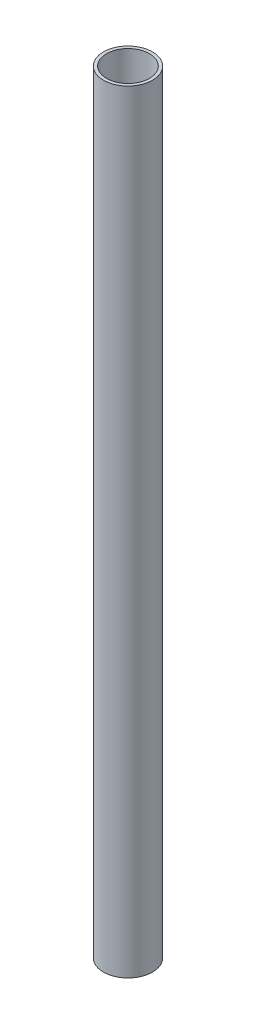
ISO-10303-21;
HEADER;
FILE_DESCRIPTION(('STEP AP214'),'2;1');
FILE_NAME('part.step','',(''),(''),'','','');
FILE_SCHEMA(('AUTOMOTIVE_DESIGN { 1 0 10303 214 1 1 1 1 }'));
ENDSEC;
DATA;
#1=APPLICATION_CONTEXT('core data for automotive mechanical design processes');
#2=APPLICATION_PROTOCOL_DEFINITION('international standard','automotive_design',2000,#1);
#3=PRODUCT_CONTEXT('',#1,'mechanical');
#4=PRODUCT('Part','Part','',(#3));
#5=PRODUCT_RELATED_PRODUCT_CATEGORY('part','',(#4));
#6=PRODUCT_DEFINITION_FORMATION('','',#4);
#7=PRODUCT_DEFINITION_CONTEXT('part definition',#1,'design');
#8=PRODUCT_DEFINITION('design','',#6,#7);
#9=PRODUCT_DEFINITION_SHAPE('','',#8);
#10=(LENGTH_UNIT() NAMED_UNIT(*) SI_UNIT(.MILLI.,.METRE.));
#11=(NAMED_UNIT(*) PLANE_ANGLE_UNIT() SI_UNIT($,.RADIAN.));
#12=(NAMED_UNIT(*) SI_UNIT($,.STERADIAN.) SOLID_ANGLE_UNIT());
#13=UNCERTAINTY_MEASURE_WITH_UNIT(LENGTH_MEASURE(1.E-05),#10,'distance_accuracy_value','');
#14=(GEOMETRIC_REPRESENTATION_CONTEXT(3) GLOBAL_UNCERTAINTY_ASSIGNED_CONTEXT((#13)) GLOBAL_UNIT_ASSIGNED_CONTEXT((#10,
#11,#12)) REPRESENTATION_CONTEXT('',''));
#15=CARTESIAN_POINT('',(0.,0.,0.));
#16=DIRECTION('',(0.,0.,1.));
#17=DIRECTION('',(1.,0.,0.));
#18=AXIS2_PLACEMENT_3D('',#15,#16,#17);
#19=CARTESIAN_POINT('',(0.,400.,0.));
#20=DIRECTION('',(0.,1.,0.));
#21=DIRECTION('',(0.,0.,1.));
#22=AXIS2_PLACEMENT_3D('',#19,#20,#21);
#23=PLANE('',#22);
#24=CARTESIAN_POINT('',(0.,400.,0.));
#25=DIRECTION('',(0.,1.,0.));
#26=DIRECTION('',(0.,0.,1.));
#27=AXIS2_PLACEMENT_3D('',#24,#25,#26);
#28=CIRCLE('',#27,12.7);
#29=CARTESIAN_POINT('',(0.,400.,12.7));
#30=VERTEX_POINT('',#29);
#31=EDGE_CURVE('E10',#30,#30,#28,.T.);
#32=ORIENTED_EDGE('',*,*,#31,.T.);
#33=EDGE_LOOP('',(#32));
#34=FACE_BOUND('',#33,.T.);
#35=CARTESIAN_POINT('',(0.,400.,0.));
#36=DIRECTION('',(0.,1.,0.));
#37=DIRECTION('',(0.,0.,1.));
#38=AXIS2_PLACEMENT_3D('',#35,#36,#37);
#39=CIRCLE('',#38,11.1125);
#40=CARTESIAN_POINT('',(0.,400.,11.1125));
#41=VERTEX_POINT('',#40);
#42=EDGE_CURVE('E48',#41,#41,#39,.T.);
#43=ORIENTED_EDGE('',*,*,#42,.F.);
#44=EDGE_LOOP('',(#43));
#45=FACE_BOUND('',#44,.T.);
#46=ADVANCED_FACE('F37',(#34,#45),#23,.T.);
#47=CARTESIAN_POINT('',(0.,0.,0.));
#48=DIRECTION('',(0.,1.,0.));
#49=DIRECTION('',(0.,0.,1.));
#50=AXIS2_PLACEMENT_3D('',#47,#48,#49);
#51=PLANE('',#50);
#52=CARTESIAN_POINT('',(0.,0.,0.));
#53=DIRECTION('',(0.,1.,0.));
#54=DIRECTION('',(0.,0.,1.));
#55=AXIS2_PLACEMENT_3D('',#52,#53,#54);
#56=CIRCLE('',#55,12.7);
#57=CARTESIAN_POINT('',(0.,0.,12.7));
#58=VERTEX_POINT('',#57);
#59=EDGE_CURVE('E41',#58,#58,#56,.T.);
#60=ORIENTED_EDGE('',*,*,#59,.F.);
#61=EDGE_LOOP('',(#60));
#62=FACE_BOUND('',#61,.T.);
#63=CARTESIAN_POINT('',(0.,0.,0.));
#64=DIRECTION('',(0.,1.,0.));
#65=DIRECTION('',(0.,0.,1.));
#66=AXIS2_PLACEMENT_3D('',#63,#64,#65);
#67=CIRCLE('',#66,11.1125);
#68=CARTESIAN_POINT('',(0.,0.,11.1125));
#69=VERTEX_POINT('',#68);
#70=EDGE_CURVE('E50',#69,#69,#67,.T.);
#71=ORIENTED_EDGE('',*,*,#70,.T.);
#72=EDGE_LOOP('',(#71));
#73=FACE_BOUND('',#72,.T.);
#74=ADVANCED_FACE('F60',(#62,#73),#51,.F.);
#75=CARTESIAN_POINT('',(0.,400.,0.));
#76=DIRECTION('',(0.,-1.,0.));
#77=DIRECTION('',(0.,0.,-1.));
#78=AXIS2_PLACEMENT_3D('',#75,#76,#77);
#79=CYLINDRICAL_SURFACE('',#78,12.7);
#80=ORIENTED_EDGE('',*,*,#31,.F.);
#81=EDGE_LOOP('',(#80));
#82=FACE_BOUND('',#81,.T.);
#83=ORIENTED_EDGE('',*,*,#59,.T.);
#84=EDGE_LOOP('',(#83));
#85=FACE_BOUND('',#84,.T.);
#86=ADVANCED_FACE('F39',(#82,#85),#79,.T.);
#87=CARTESIAN_POINT('',(0.,400.,0.));
#88=DIRECTION('',(0.,-1.,0.));
#89=DIRECTION('',(0.,0.,-1.));
#90=AXIS2_PLACEMENT_3D('',#87,#88,#89);
#91=CYLINDRICAL_SURFACE('',#90,11.1125);
#92=ORIENTED_EDGE('',*,*,#42,.T.);
#93=EDGE_LOOP('',(#92));
#94=FACE_BOUND('',#93,.T.);
#95=ORIENTED_EDGE('',*,*,#70,.F.);
#96=EDGE_LOOP('',(#95));
#97=FACE_BOUND('',#96,.T.);
#98=ADVANCED_FACE('F56',(#94,#97),#91,.F.);
#99=CLOSED_SHELL('',(#46,#74,#86,#98));
#100=MANIFOLD_SOLID_BREP('B2',#99);
#101=ADVANCED_BREP_SHAPE_REPRESENTATION('',(#18,#100),#14);
#102=SHAPE_DEFINITION_REPRESENTATION(#9,#101);
ENDSEC;
END-ISO-10303-21;
